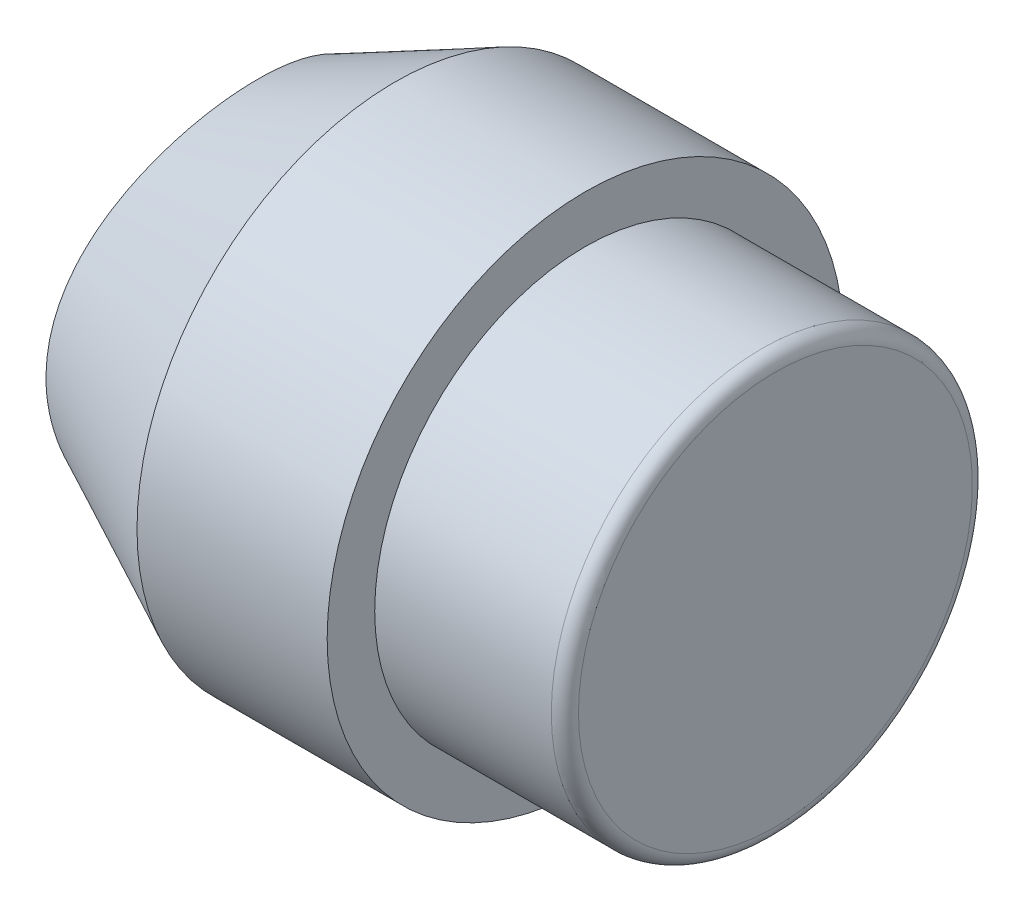
ISO-10303-21;
HEADER;
FILE_DESCRIPTION(('STEP AP214'),'2;1');
FILE_NAME('part.step','',(''),(''),'','','');
FILE_SCHEMA(('AUTOMOTIVE_DESIGN { 1 0 10303 214 1 1 1 1 }'));
ENDSEC;
DATA;
#1=APPLICATION_CONTEXT('core data for automotive mechanical design processes');
#2=APPLICATION_PROTOCOL_DEFINITION('international standard','automotive_design',2000,#1);
#3=PRODUCT_CONTEXT('',#1,'mechanical');
#4=PRODUCT('Part','Part','',(#3));
#5=PRODUCT_RELATED_PRODUCT_CATEGORY('part','',(#4));
#6=PRODUCT_DEFINITION_FORMATION('','',#4);
#7=PRODUCT_DEFINITION_CONTEXT('part definition',#1,'design');
#8=PRODUCT_DEFINITION('design','',#6,#7);
#9=PRODUCT_DEFINITION_SHAPE('','',#8);
#10=(LENGTH_UNIT() NAMED_UNIT(*) SI_UNIT(.MILLI.,.METRE.));
#11=(NAMED_UNIT(*) PLANE_ANGLE_UNIT() SI_UNIT($,.RADIAN.));
#12=(NAMED_UNIT(*) SI_UNIT($,.STERADIAN.) SOLID_ANGLE_UNIT());
#13=UNCERTAINTY_MEASURE_WITH_UNIT(LENGTH_MEASURE(1.E-05),#10,'distance_accuracy_value','');
#14=(GEOMETRIC_REPRESENTATION_CONTEXT(3) GLOBAL_UNCERTAINTY_ASSIGNED_CONTEXT((#13)) GLOBAL_UNIT_ASSIGNED_CONTEXT((#10,
#11,#12)) REPRESENTATION_CONTEXT('',''));
#15=CARTESIAN_POINT('',(0.,0.,0.));
#16=DIRECTION('',(0.,0.,1.));
#17=DIRECTION('',(1.,0.,0.));
#18=AXIS2_PLACEMENT_3D('',#15,#16,#17);
#19=CARTESIAN_POINT('',(28.1183466139397,0.,0.));
#20=DIRECTION('',(-1.,0.,0.));
#21=DIRECTION('',(0.,0.,1.));
#22=AXIS2_PLACEMENT_3D('',#19,#20,#21);
#23=PLANE('',#22);
#24=CARTESIAN_POINT('',(28.1183466139397,0.,0.));
#25=DIRECTION('',(-1.,0.,0.));
#26=DIRECTION('',(0.,0.,1.));
#27=AXIS2_PLACEMENT_3D('',#24,#25,#26);
#28=CIRCLE('',#27,7.25);
#29=CARTESIAN_POINT('',(28.1183466139397,0.,7.25));
#30=VERTEX_POINT('',#29);
#31=EDGE_CURVE('E10',#30,#30,#28,.F.);
#32=ORIENTED_EDGE('',*,*,#31,.T.);
#33=EDGE_LOOP('',(#32));
#34=FACE_BOUND('',#33,.T.);
#35=ADVANCED_FACE('F35',(#34),#23,.F.);
#36=CARTESIAN_POINT('',(0.,0.,0.));
#37=DIRECTION('',(-1.,0.,0.));
#38=DIRECTION('',(0.,0.,1.));
#39=AXIS2_PLACEMENT_3D('',#36,#37,#38);
#40=CYLINDRICAL_SURFACE('',#39,7.75);
#41=CARTESIAN_POINT('',(27.6183466139397,0.,0.));
#42=DIRECTION('',(-1.,0.,0.));
#43=DIRECTION('',(0.,0.,1.));
#44=AXIS2_PLACEMENT_3D('',#41,#42,#43);
#45=CIRCLE('',#44,7.75);
#46=CARTESIAN_POINT('',(27.6183466139397,0.,7.75));
#47=VERTEX_POINT('',#46);
#48=EDGE_CURVE('E42',#47,#47,#45,.T.);
#49=ORIENTED_EDGE('',*,*,#48,.T.);
#50=EDGE_LOOP('',(#49));
#51=FACE_BOUND('',#50,.T.);
#52=CARTESIAN_POINT('',(21.1183466139397,0.,0.));
#53=DIRECTION('',(-1.,0.,0.));
#54=DIRECTION('',(0.,0.,1.));
#55=AXIS2_PLACEMENT_3D('',#52,#53,#54);
#56=CIRCLE('',#55,7.75);
#57=CARTESIAN_POINT('',(21.1183466139397,0.,7.75));
#58=VERTEX_POINT('',#57);
#59=EDGE_CURVE('E46',#58,#58,#56,.T.);
#60=ORIENTED_EDGE('',*,*,#59,.F.);
#61=EDGE_LOOP('',(#60));
#62=FACE_BOUND('',#61,.T.);
#63=ADVANCED_FACE('F81',(#51,#62),#40,.T.);
#64=CARTESIAN_POINT('',(21.1183466139397,0.,-7.75));
#65=DIRECTION('',(-1.,0.,0.));
#66=DIRECTION('',(0.,0.,1.));
#67=AXIS2_PLACEMENT_3D('',#64,#65,#66);
#68=PLANE('',#67);
#69=CARTESIAN_POINT('',(21.1183466139397,0.,0.));
#70=DIRECTION('',(-1.,0.,0.));
#71=DIRECTION('',(0.,0.,1.));
#72=AXIS2_PLACEMENT_3D('',#69,#70,#71);
#73=CIRCLE('',#72,9.5);
#74=CARTESIAN_POINT('',(21.1183466139397,0.,9.5));
#75=VERTEX_POINT('',#74);
#76=EDGE_CURVE('E50',#75,#75,#73,.T.);
#77=ORIENTED_EDGE('',*,*,#76,.F.);
#78=EDGE_LOOP('',(#77));
#79=FACE_BOUND('',#78,.T.);
#80=ORIENTED_EDGE('',*,*,#59,.T.);
#81=EDGE_LOOP('',(#80));
#82=FACE_BOUND('',#81,.T.);
#83=ADVANCED_FACE('F85',(#79,#82),#68,.F.);
#84=CARTESIAN_POINT('',(0.,0.,0.));
#85=DIRECTION('',(-1.,0.,0.));
#86=DIRECTION('',(0.,0.,1.));
#87=AXIS2_PLACEMENT_3D('',#84,#85,#86);
#88=CYLINDRICAL_SURFACE('',#87,9.5);
#89=CARTESIAN_POINT('',(14.1183466139397,0.,0.));
#90=DIRECTION('',(-1.,0.,0.));
#91=DIRECTION('',(0.,0.,1.));
#92=AXIS2_PLACEMENT_3D('',#89,#90,#91);
#93=CIRCLE('',#92,9.5);
#94=CARTESIAN_POINT('',(14.1183466139397,0.,9.5));
#95=VERTEX_POINT('',#94);
#96=EDGE_CURVE('E55',#95,#95,#93,.T.);
#97=ORIENTED_EDGE('',*,*,#96,.F.);
#98=EDGE_LOOP('',(#97));
#99=FACE_BOUND('',#98,.T.);
#100=ORIENTED_EDGE('',*,*,#76,.T.);
#101=EDGE_LOOP('',(#100));
#102=FACE_BOUND('',#101,.T.);
#103=ADVANCED_FACE('F77',(#99,#102),#88,.T.);
#104=CARTESIAN_POINT('',(14.1183466139397,0.,0.));
#105=DIRECTION('',(1.,0.,0.));
#106=DIRECTION('',(0.,0.,-1.));
#107=AXIS2_PLACEMENT_3D('',#104,#105,#106);
#108=CONICAL_SURFACE('',#107,9.5,0.45126434108292);
#109=CARTESIAN_POINT('',(8.49196840381368,-5.4536039473167,-4.01705766582874));
#110=CARTESIAN_POINT('',(8.41023439088613,-5.1904052452919,-4.30759488802837));
#111=CARTESIAN_POINT('',(8.32570198248313,-4.90143213144193,-4.57402226719815));
#112=CARTESIAN_POINT('',(8.16077373690051,-4.28160010488205,-5.05471641664884));
#113=CARTESIAN_POINT('',(8.08038104351866,-3.95071000046141,-5.26894399279986));
#114=CARTESIAN_POINT('',(7.96969212695256,-3.42978838460011,-5.54880534665937));
#115=CARTESIAN_POINT('',(7.9343900509077,-3.25169956216048,-5.63529985826776));
#116=CARTESIAN_POINT('',(7.86814722194096,-2.88849481073551,-5.7939745211978));
#117=CARTESIAN_POINT('',(7.8372049008936,-2.70338143891968,-5.86615982310555));
#118=CARTESIAN_POINT('',(7.78062287113327,-2.32731693869339,-5.99586624067032));
#119=CARTESIAN_POINT('',(7.75498295750291,-2.13636603620823,-6.05338792303908));
#120=CARTESIAN_POINT('',(7.70981453438618,-1.74993978026369,-6.15343946395158));
#121=CARTESIAN_POINT('',(7.69028371595052,-1.55446616624819,-6.19597498732526));
#122=CARTESIAN_POINT('',(7.65765152660333,-1.1565450129513,-6.26647430505763));
#123=CARTESIAN_POINT('',(7.64467830462797,-0.954035472131314,-6.29414827664284));
#124=CARTESIAN_POINT('',(7.62617254502329,-0.547125354010197,-6.33348983327241));
#125=CARTESIAN_POINT('',(7.62064010576904,-0.342724751743197,-6.34515720669257));
#126=CARTESIAN_POINT('',(7.6172110457171,0.0664194633045356,-6.352398024587));
#127=CARTESIAN_POINT('',(7.61931419391983,0.271163065521177,-6.34797195593648));
#128=CARTESIAN_POINT('',(7.63108170687187,0.679448077559806,-6.32306004285081));
#129=CARTESIAN_POINT('',(7.64074592775314,0.882989510181786,-6.30257450398663));
#130=CARTESIAN_POINT('',(7.66692243825775,1.28165999575466,-6.24649548584752));
#131=CARTESIAN_POINT('',(7.68323434062568,1.47686458452245,-6.21134343144922));
#132=CARTESIAN_POINT('',(7.72215884846332,1.8634475849522,-6.12622379973519));
#133=CARTESIAN_POINT('',(7.74477371561498,2.0548245967031,-6.07625090386909));
#134=CARTESIAN_POINT('',(7.79559011445769,2.43239636344888,-5.96179115680291));
#135=CARTESIAN_POINT('',(7.8237909626757,2.61859174926633,-5.89730608111014));
#136=CARTESIAN_POINT('',(7.88493850986499,2.98470429260736,-5.75412326729912));
#137=CARTESIAN_POINT('',(7.91788690289776,3.16461918047799,-5.67542045332566));
#138=CARTESIAN_POINT('',(7.9883507340774,3.52098168009185,-5.50221880044521));
#139=CARTESIAN_POINT('',(8.02595298604772,3.69725742169799,-5.40740146937162));
#140=CARTESIAN_POINT('',(8.10398421048433,4.04080803801472,-5.20367170817781));
#141=CARTESIAN_POINT('',(8.1444131580875,4.20808299187178,-5.09475940202736));
#142=CARTESIAN_POINT('',(8.2269374692755,4.53255780191501,-4.86316799287196));
#143=CARTESIAN_POINT('',(8.26903389215011,4.68975108197023,-4.74048004486501));
#144=CARTESIAN_POINT('',(8.35360933321348,4.99265144922766,-4.48189366924683));
#145=CARTESIAN_POINT('',(8.39608817884584,5.13836345338711,-4.34600095299106));
#146=CARTESIAN_POINT('',(8.4802407303415,5.41732007215483,-4.06123265388781));
#147=CARTESIAN_POINT('',(8.52191290864172,5.55054257943042,-3.91233491839566));
#148=CARTESIAN_POINT('',(8.60304304131707,5.80277361200114,-3.60249353010392));
#149=CARTESIAN_POINT('',(8.64250210949433,5.92178932187205,-3.44155603354182));
#150=CARTESIAN_POINT('',(8.71788922342083,6.14413983075718,-3.10853164481046));
#151=CARTESIAN_POINT('',(8.75381938125912,6.24748402973115,-2.93645152522561));
#152=CARTESIAN_POINT('',(8.82088453879719,6.43704340063474,-2.58221203506016));
#153=CARTESIAN_POINT('',(8.85202040380361,6.5232616643864,-2.40005449140797));
#154=CARTESIAN_POINT('',(8.90506221251081,6.66824541946154,-2.04860762902299));
#155=CARTESIAN_POINT('',(8.92761780781713,6.72902767848468,-1.88024725200098));
#156=CARTESIAN_POINT('',(8.96730487325581,6.83508591573796,-1.53809885252976));
#157=CARTESIAN_POINT('',(8.98443732698953,6.88036470597176,-1.36431182060825));
#158=CARTESIAN_POINT('',(9.01268049024704,6.95462021185039,-1.01296713831553));
#159=CARTESIAN_POINT('',(9.02379667369929,6.98361174743773,-0.835413068802494));
#160=CARTESIAN_POINT('',(9.03963151940978,7.02482168690779,-0.478091744632682));
#161=CARTESIAN_POINT('',(9.04435099317173,7.03704221840748,-0.298324773630907));
#162=CARTESIAN_POINT('',(9.04702791766563,7.04397767111617,0.0369205737966155));
#163=CARTESIAN_POINT('',(9.04582333776651,7.04086188730189,0.192351747230063));
#164=CARTESIAN_POINT('',(9.03856133592047,7.02202298001312,0.502383607244779));
#165=CARTESIAN_POINT('',(9.03250245386082,7.00629606326801,0.656984029859381));
#166=CARTESIAN_POINT('',(9.01569474921919,6.96245370688952,0.96409034567174));
#167=CARTESIAN_POINT('',(9.00494803440372,6.93434383488559,1.11659714846288));
#168=CARTESIAN_POINT('',(8.97905494180688,6.86612489351658,1.41854152979794));
#169=CARTESIAN_POINT('',(8.96390687360555,6.82601121369308,1.567977905433));
#170=CARTESIAN_POINT('',(8.91308874096908,6.69018837174794,2.00432470434632));
#171=CARTESIAN_POINT('',(8.87166986402731,6.57805591028226,2.28563210277064));
#172=CARTESIAN_POINT('',(8.77705142577124,6.3142450683919,2.82662049856719));
#173=CARTESIAN_POINT('',(8.72384855312002,6.16255557019614,3.08629538886148));
#174=CARTESIAN_POINT('',(8.60415541722479,5.80753181040106,3.60530216687812));
#175=CARTESIAN_POINT('',(8.53686500479852,5.60052179171036,3.86193274795191));
#176=CARTESIAN_POINT('',(8.39904443945794,5.15105034057606,4.34098369392271));
#177=CARTESIAN_POINT('',(8.32851238940451,4.90856796229893,4.56338368589787));
#178=CARTESIAN_POINT('',(8.18029573524464,4.35810256277286,5.0000725312788));
#179=CARTESIAN_POINT('',(8.10298221650537,4.04570035328957,5.20892268737643));
#180=CARTESIAN_POINT('',(7.95954800985196,3.39004854425763,5.5764946481034));
#181=CARTESIAN_POINT('',(7.8934318749751,3.0467864830255,5.7351960840533));
#182=CARTESIAN_POINT('',(7.80584776444511,2.50196197002227,5.93853310227206));
#183=CARTESIAN_POINT('',(7.77786855896342,2.30824554964168,6.0019850613455));
#184=CARTESIAN_POINT('',(7.72806066848029,1.91555443787785,6.11332036911247));
#185=CARTESIAN_POINT('',(7.70623229332907,1.71657948214613,6.16120293351103));
#186=CARTESIAN_POINT('',(7.66948444474439,1.3148909747928,6.24105486280355));
#187=CARTESIAN_POINT('',(7.654563348937,1.11217831272266,6.27302796462624));
#188=CARTESIAN_POINT('',(7.63213775906108,0.704454045886563,6.32085915279145));
#189=CARTESIAN_POINT('',(7.62463299700269,0.499442524460845,6.33671782143098));
#190=CARTESIAN_POINT('',(7.61737751330015,0.0926926850862273,6.35205084328142));
#191=CARTESIAN_POINT('',(7.61747796225186,-0.10903120048655,6.35183967314823));
#192=CARTESIAN_POINT('',(7.62505906809451,-0.511717846623277,6.33581619205667));
#193=CARTESIAN_POINT('',(7.63253967065829,-0.712680612779085,6.32000399594132));
#194=CARTESIAN_POINT('',(7.65462693885393,-1.1123952286023,6.27289022962025));
#195=CARTESIAN_POINT('',(7.66923404068644,-1.31114694217327,6.24158771127711));
#196=CARTESIAN_POINT('',(7.70508636335547,-1.70502190954543,6.16370384187951));
#197=CARTESIAN_POINT('',(7.72633162206873,-1.90014514263608,6.11712240364478));
#198=CARTESIAN_POINT('',(7.77453862850741,-2.28358695553356,6.00948451844623));
#199=CARTESIAN_POINT('',(7.80144379556593,-2.47195274946424,5.94857068308687));
#200=CARTESIAN_POINT('',(7.86027207735464,-2.84266845371417,5.8123360833892));
#201=CARTESIAN_POINT('',(7.89219701423003,-3.02501615030709,5.73701008536421));
#202=CARTESIAN_POINT('',(7.96010971939823,-3.38247498454393,5.57231307299821));
#203=CARTESIAN_POINT('',(7.99609763088345,-3.55758586684173,5.48294156360423));
#204=CARTESIAN_POINT('',(8.07110853817144,-3.89950572793366,5.29048639732274));
#205=CARTESIAN_POINT('',(8.11013259574174,-4.06631176870383,5.18739793446096));
#206=CARTESIAN_POINT('',(8.1913316638465,-4.39544595874946,4.96452134789355));
#207=CARTESIAN_POINT('',(8.23356673107973,-4.55747741309155,4.84431629206127));
#208=CARTESIAN_POINT('',(8.31880655816779,-4.87022270342848,4.59019547249575));
#209=CARTESIAN_POINT('',(8.36181137327736,-5.02093572288579,4.45627872121367));
#210=CARTESIAN_POINT('',(8.447284148039,-5.30974780998744,4.17521594653656));
#211=CARTESIAN_POINT('',(8.48975196270852,-5.44784353124997,4.02806643394049));
#212=CARTESIAN_POINT('',(8.57276889145105,-5.70989085108973,3.72128262631281));
#213=CARTESIAN_POINT('',(8.61331904318561,-5.83385015145387,3.56165521015316));
#214=CARTESIAN_POINT('',(8.68933906063938,-6.0607527338468,3.2384438983236));
#215=CARTESIAN_POINT('',(8.72495796536936,-6.16440877065377,3.07539620732765));
#216=CARTESIAN_POINT('',(8.79206040190503,-6.35617414998123,2.73969235175936));
#217=CARTESIAN_POINT('',(8.82354632842052,-6.44429250552078,2.56704183451745));
#218=CARTESIAN_POINT('',(8.88127467977284,-6.60362695010068,2.21345919220492));
#219=CARTESIAN_POINT('',(8.90752228836852,-6.67485976205844,2.03253547434439));
#220=CARTESIAN_POINT('',(8.95382142768666,-6.79927215738176,1.66382005711436));
#221=CARTESIAN_POINT('',(8.97387421984504,-6.85245541635316,1.47602976469082));
#222=CARTESIAN_POINT('',(9.00458445251038,-6.93340152671706,1.12308860879022));
#223=CARTESIAN_POINT('',(9.01618275914867,-6.9637325783393,0.958604653734462));
#224=CARTESIAN_POINT('',(9.03391614037492,-7.00997701425361,0.627337679785919));
#225=CARTESIAN_POINT('',(9.04005192857992,-7.02589228181165,0.460554964092234));
#226=CARTESIAN_POINT('',(9.04666547125062,-7.04304308023371,0.126199941275895));
#227=CARTESIAN_POINT('',(9.04714575974595,-7.04428518562412,-0.0413719785590917));
#228=CARTESIAN_POINT('',(9.04244009327744,-7.03208729961113,-0.375894703373791));
#229=CARTESIAN_POINT('',(9.03725438708182,-7.01864795280394,-0.542845535299754));
#230=CARTESIAN_POINT('',(9.0221495494713,-6.97930954336255,-0.858609236809055));
#231=CARTESIAN_POINT('',(9.01273707364063,-6.95474216647085,-1.00761381626962));
#232=CARTESIAN_POINT('',(8.98966825190304,-6.89413864225244,-1.30295119768616));
#233=CARTESIAN_POINT('',(8.97601061565608,-6.85809900778901,-1.44928317295172));
#234=CARTESIAN_POINT('',(8.9291481154989,-6.73340284446808,-1.88275637605723));
#235=CARTESIAN_POINT('',(8.89003950198547,-6.62813358927343,-2.1646520578819));
#236=CARTESIAN_POINT('',(8.79656158392281,-6.36941789951335,-2.72617157365579));
#237=CARTESIAN_POINT('',(8.74134044418228,-6.21319938623746,-3.00435796492841));
#238=CARTESIAN_POINT('',(8.62201398242663,-5.86146656079027,-3.53262669647639));
#239=CARTESIAN_POINT('',(8.55790169955577,-5.6659214053487,-3.7826867361602));
#240=CARTESIAN_POINT('',(8.49196840381368,-5.4536039473167,-4.01705766582874));
#241=B_SPLINE_CURVE_WITH_KNOTS('',3,(#109,#110,#111,#112,#113,#114,#115,#116,#117,#118,#119,
#120,#121,#122,#123,#124,#125,#126,#127,#128,#129,#130,#131,#132,#133,#134,#135,#136,#137,#138,
#139,#140,#141,#142,#143,#144,#145,#146,#147,#148,#149,#150,#151,#152,#153,#154,#155,#156,#157,
#158,#159,#160,#161,#162,#163,#164,#165,#166,#167,#168,#169,#170,#171,#172,#173,#174,#175,#176,
#177,#178,#179,#180,#181,#182,#183,#184,#185,#186,#187,#188,#189,#190,#191,#192,#193,#194,#195,
#196,#197,#198,#199,#200,#201,#202,#203,#204,#205,#206,#207,#208,#209,#210,#211,#212,#213,#214,
#215,#216,#217,#218,#219,#220,#221,#222,#223,#224,#225,#226,#227,#228,#229,#230,#231,#232,#233,
#234,#235,#236,#237,#238,#239,#240),.UNSPECIFIED.,.T.,.F.,(4,2,2,2,2,2,2,2,2,2,2,2,2,2,2,2,2,2,
2,2,2,2,2,2,2,2,2,2,2,2,2,2,2,2,2,2,2,2,2,2,2,2,2,2,2,2,2,2,2,2,2,2,2,2,2,2,2,2,2,2,2,2,2,2,2,
4),(0.,1.20017064656267,2.40123968131069,3.00399690661521,3.60653677449851,4.20905335221089,
4.81134193119582,5.42498483593763,6.03863585361116,6.65226830664311,7.26588908408983,
7.86224009124098,8.45880536210696,9.05529768523301,9.65200338362913,10.2622776021854,
10.8725464535518,11.4832094088085,12.0936094045909,12.7050702221919,13.3162204935789,
13.9270027272965,14.5376745933328,15.0781243689356,15.6184760663076,16.1583352923879,
16.6981260240683,17.1639504207631,17.6299149841744,18.0956702539023,18.5616046424156,
19.4743914805847,20.3874351406463,21.393002141797,22.3991653282174,23.5453901980307,
24.6920800281962,25.3087116129818,25.9253742552467,26.5418919829098,27.1583874318378,
27.7628216145733,28.3672513479517,28.9717180820675,29.5761882652809,30.1748807648584,
30.7737910899378,31.3727225291538,31.9718643697517,32.5894815779582,33.2071432997522,
33.8249683661942,34.4424552054324,35.0309973209316,35.6191969066836,36.2068115010435,
36.7943063618331,37.2965898306827,37.7988076721724,38.3008004790232,38.8027712465243,
39.256162730583,39.7096921604845,40.6159217428973,41.5833152093968,42.5514703671635),.UNSPECIFIED.);
#242=CARTESIAN_POINT('',(8.49196840381368,-5.4536039473167,-4.01705766582874));
#243=VERTEX_POINT('',#242);
#244=EDGE_CURVE('E58',#243,#243,#241,.T.);
#245=ORIENTED_EDGE('',*,*,#244,.T.);
#246=EDGE_LOOP('',(#245));
#247=FACE_BOUND('',#246,.T.);
#248=ORIENTED_EDGE('',*,*,#96,.T.);
#249=EDGE_LOOP('',(#248));
#250=FACE_BOUND('',#249,.T.);
#251=ADVANCED_FACE('F65',(#247,#250),#108,.T.);
#252=CARTESIAN_POINT('',(-5.78707310264431,-9.5,0.));
#253=DIRECTION('',(0.,1.,0.));
#254=DIRECTION('',(0.,0.,1.));
#255=AXIS2_PLACEMENT_3D('',#252,#253,#254);
#256=CYLINDRICAL_SURFACE('',#255,14.8333333333334);
#257=ORIENTED_EDGE('',*,*,#244,.F.);
#258=EDGE_LOOP('',(#257));
#259=FACE_BOUND('',#258,.T.);
#260=ADVANCED_FACE('F68',(#259),#256,.F.);
#261=CARTESIAN_POINT('',(27.6183466139397,0.,0.));
#262=DIRECTION('',(-1.,0.,0.));
#263=DIRECTION('',(0.,0.,1.));
#264=AXIS2_PLACEMENT_3D('',#261,#262,#263);
#265=TOROIDAL_SURFACE('',#264,7.25,0.5);
#266=ORIENTED_EDGE('',*,*,#31,.F.);
#267=EDGE_LOOP('',(#266));
#268=FACE_BOUND('',#267,.T.);
#269=ORIENTED_EDGE('',*,*,#48,.F.);
#270=EDGE_LOOP('',(#269));
#271=FACE_BOUND('',#270,.T.);
#272=ADVANCED_FACE('F37',(#268,#271),#265,.T.);
#273=CLOSED_SHELL('',(#35,#63,#83,#103,#251,#260,#272));
#274=MANIFOLD_SOLID_BREP('B2',#273);
#275=ADVANCED_BREP_SHAPE_REPRESENTATION('',(#18,#274),#14);
#276=SHAPE_DEFINITION_REPRESENTATION(#9,#275);
ENDSEC;
END-ISO-10303-21;
